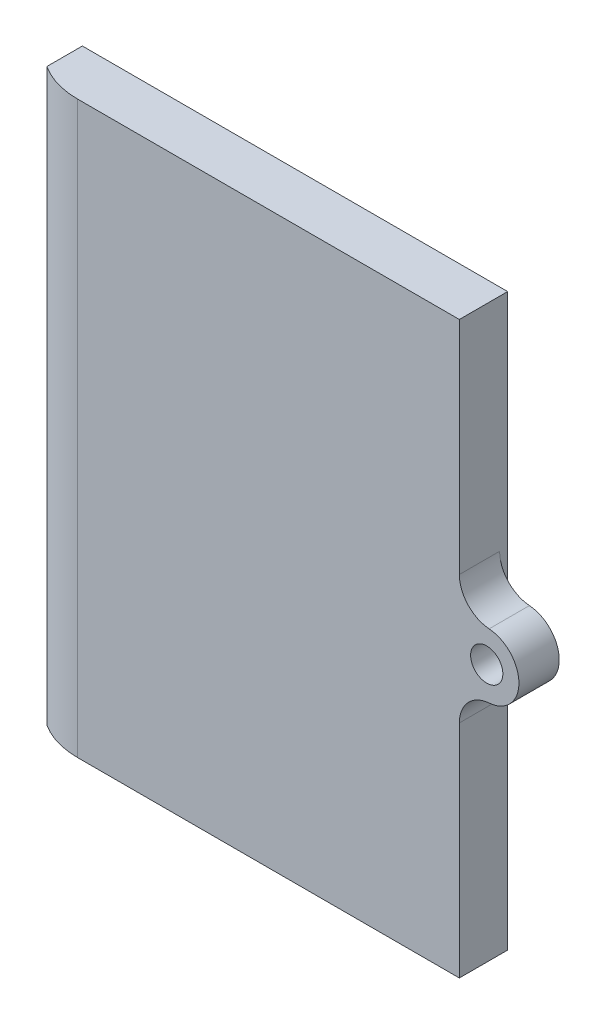
ISO-10303-21;
HEADER;
FILE_DESCRIPTION(('STEP AP214'),'2;1');
FILE_NAME('part.step','',(''),(''),'','','');
FILE_SCHEMA(('AUTOMOTIVE_DESIGN { 1 0 10303 214 1 1 1 1 }'));
ENDSEC;
DATA;
#1=APPLICATION_CONTEXT('core data for automotive mechanical design processes');
#2=APPLICATION_PROTOCOL_DEFINITION('international standard','automotive_design',2000,#1);
#3=PRODUCT_CONTEXT('',#1,'mechanical');
#4=PRODUCT('Part','Part','',(#3));
#5=PRODUCT_RELATED_PRODUCT_CATEGORY('part','',(#4));
#6=PRODUCT_DEFINITION_FORMATION('','',#4);
#7=PRODUCT_DEFINITION_CONTEXT('part definition',#1,'design');
#8=PRODUCT_DEFINITION('design','',#6,#7);
#9=PRODUCT_DEFINITION_SHAPE('','',#8);
#10=(LENGTH_UNIT() NAMED_UNIT(*) SI_UNIT(.MILLI.,.METRE.));
#11=(NAMED_UNIT(*) PLANE_ANGLE_UNIT() SI_UNIT($,.RADIAN.));
#12=(NAMED_UNIT(*) SI_UNIT($,.STERADIAN.) SOLID_ANGLE_UNIT());
#13=UNCERTAINTY_MEASURE_WITH_UNIT(LENGTH_MEASURE(1.E-05),#10,'distance_accuracy_value','');
#14=(GEOMETRIC_REPRESENTATION_CONTEXT(3) GLOBAL_UNCERTAINTY_ASSIGNED_CONTEXT((#13)) GLOBAL_UNIT_ASSIGNED_CONTEXT((#10,
#11,#12)) REPRESENTATION_CONTEXT('',''));
#15=CARTESIAN_POINT('',(0.,0.,0.));
#16=DIRECTION('',(0.,0.,1.));
#17=DIRECTION('',(1.,0.,0.));
#18=AXIS2_PLACEMENT_3D('',#15,#16,#17);
#19=CARTESIAN_POINT('',(-12.,35.4,-2.5));
#20=DIRECTION('',(0.,-1.,0.));
#21=DIRECTION('',(0.,0.,-1.));
#22=AXIS2_PLACEMENT_3D('',#19,#20,#21);
#23=CYLINDRICAL_SURFACE('',#22,5.);
#24=CARTESIAN_POINT('',(-12.,35.4,-2.5));
#25=DIRECTION('',(0.,1.,0.));
#26=DIRECTION('',(0.,0.,-1.));
#27=AXIS2_PLACEMENT_3D('',#24,#25,#26);
#28=CIRCLE('',#27,5.);
#29=CARTESIAN_POINT('',(-14.7,35.4,1.70832508250016));
#30=VERTEX_POINT('',#29);
#31=CARTESIAN_POINT('',(-12.,35.4,2.5));
#32=VERTEX_POINT('',#31);
#33=EDGE_CURVE('E146',#30,#32,#28,.T.);
#34=ORIENTED_EDGE('',*,*,#33,.F.);
#35=DIRECTION('',(0.,-1.,0.));
#36=VECTOR('',#35,1.);
#37=CARTESIAN_POINT('',(-14.7,35.4,1.70832508250016));
#38=LINE('',#37,#36);
#39=CARTESIAN_POINT('',(-14.7,0.,1.70832508250016));
#40=VERTEX_POINT('',#39);
#41=EDGE_CURVE('E132',#30,#40,#38,.T.);
#42=ORIENTED_EDGE('',*,*,#41,.T.);
#43=CARTESIAN_POINT('',(-12.,0.,-2.5));
#44=DIRECTION('',(0.,1.,0.));
#45=DIRECTION('',(0.,0.,-1.));
#46=AXIS2_PLACEMENT_3D('',#43,#44,#45);
#47=CIRCLE('',#46,5.);
#48=CARTESIAN_POINT('',(-12.,0.,2.5));
#49=VERTEX_POINT('',#48);
#50=EDGE_CURVE('E131',#40,#49,#47,.T.);
#51=ORIENTED_EDGE('',*,*,#50,.T.);
#52=DIRECTION('',(0.,-1.,0.));
#53=VECTOR('',#52,1.);
#54=CARTESIAN_POINT('',(-12.,35.4,2.5));
#55=LINE('',#54,#53);
#56=EDGE_CURVE('E122',#32,#49,#55,.T.);
#57=ORIENTED_EDGE('',*,*,#56,.F.);
#58=EDGE_LOOP('',(#34,#42,#51,#57));
#59=FACE_BOUND('',#58,.T.);
#60=ADVANCED_FACE('F40',(#59),#23,.T.);
#61=CARTESIAN_POINT('',(-12.,35.4,2.5));
#62=DIRECTION('',(0.,0.,-1.));
#63=DIRECTION('',(-1.,0.,0.));
#64=AXIS2_PLACEMENT_3D('',#61,#62,#63);
#65=PLANE('',#64);
#66=DIRECTION('',(1.,0.,0.));
#67=VECTOR('',#66,1.);
#68=CARTESIAN_POINT('',(-12.,0.,2.5));
#69=LINE('',#68,#67);
#70=CARTESIAN_POINT('',(11.7,0.,2.5));
#71=VERTEX_POINT('',#70);
#72=EDGE_CURVE('E139',#49,#71,#69,.T.);
#73=ORIENTED_EDGE('',*,*,#72,.T.);
#74=DIRECTION('',(0.,1.,0.));
#75=VECTOR('',#74,1.);
#76=CARTESIAN_POINT('',(11.7,38.616725582953,2.5));
#77=LINE('',#76,#75);
#78=CARTESIAN_POINT('',(11.7,13.7112658649642,2.5));
#79=VERTEX_POINT('',#78);
#80=EDGE_CURVE('E133',#71,#79,#77,.T.);
#81=ORIENTED_EDGE('',*,*,#80,.T.);
#82=CARTESIAN_POINT('',(13.7,13.7112658649642,2.5));
#83=DIRECTION('',(0.,0.,-1.));
#84=DIRECTION('',(-1.,0.,0.));
#85=AXIS2_PLACEMENT_3D('',#82,#83,#84);
#86=CIRCLE('',#85,2.);
#87=CARTESIAN_POINT('',(13.55,15.7056329324821,2.5));
#88=VERTEX_POINT('',#87);
#89=EDGE_CURVE('E62',#79,#88,#86,.T.);
#90=ORIENTED_EDGE('',*,*,#89,.T.);
#91=CARTESIAN_POINT('',(13.4,17.7,2.5));
#92=DIRECTION('',(0.,0.,1.));
#93=DIRECTION('',(1.,0.,0.));
#94=AXIS2_PLACEMENT_3D('',#91,#92,#93);
#95=CIRCLE('',#94,2.);
#96=CARTESIAN_POINT('',(13.55,19.6943670675179,2.5));
#97=VERTEX_POINT('',#96);
#98=EDGE_CURVE('E175',#88,#97,#95,.T.);
#99=ORIENTED_EDGE('',*,*,#98,.T.);
#100=CARTESIAN_POINT('',(13.7,21.6887341350358,2.5));
#101=DIRECTION('',(0.,0.,-1.));
#102=DIRECTION('',(-1.,0.,0.));
#103=AXIS2_PLACEMENT_3D('',#100,#101,#102);
#104=CIRCLE('',#103,2.);
#105=CARTESIAN_POINT('',(11.7,21.6887341350358,2.5));
#106=VERTEX_POINT('',#105);
#107=EDGE_CURVE('E48',#97,#106,#104,.T.);
#108=ORIENTED_EDGE('',*,*,#107,.T.);
#109=CARTESIAN_POINT('',(11.7,35.4,2.5));
#110=VERTEX_POINT('',#109);
#111=EDGE_CURVE('E173',#106,#110,#77,.T.);
#112=ORIENTED_EDGE('',*,*,#111,.T.);
#113=DIRECTION('',(1.,0.,0.));
#114=VECTOR('',#113,1.);
#115=CARTESIAN_POINT('',(-12.,35.4,2.5));
#116=LINE('',#115,#114);
#117=EDGE_CURVE('E148',#32,#110,#116,.T.);
#118=ORIENTED_EDGE('',*,*,#117,.F.);
#119=ORIENTED_EDGE('',*,*,#56,.T.);
#120=EDGE_LOOP('',(#73,#81,#90,#99,#108,#112,#118,#119));
#121=FACE_BOUND('',#120,.T.);
#122=CARTESIAN_POINT('',(13.4,17.7,2.5));
#123=DIRECTION('',(0.,0.,1.));
#124=DIRECTION('',(1.,0.,0.));
#125=AXIS2_PLACEMENT_3D('',#122,#123,#124);
#126=CIRCLE('',#125,1.);
#127=CARTESIAN_POINT('',(14.4,17.7,2.5));
#128=VERTEX_POINT('',#127);
#129=EDGE_CURVE('E198',#128,#128,#126,.T.);
#130=ORIENTED_EDGE('',*,*,#129,.F.);
#131=EDGE_LOOP('',(#130));
#132=FACE_BOUND('',#131,.T.);
#133=ADVANCED_FACE('F170',(#121,#132),#65,.F.);
#134=CARTESIAN_POINT('',(-12.,35.4,-2.5));
#135=DIRECTION('',(0.,-1.,0.));
#136=DIRECTION('',(0.,0.,-1.));
#137=AXIS2_PLACEMENT_3D('',#134,#135,#136);
#138=PLANE('',#137);
#139=ORIENTED_EDGE('',*,*,#117,.T.);
#140=DIRECTION('',(0.,0.,-1.));
#141=VECTOR('',#140,1.);
#142=CARTESIAN_POINT('',(11.7,35.4,-2.5));
#143=LINE('',#142,#141);
#144=CARTESIAN_POINT('',(11.7,35.4,-0.5));
#145=VERTEX_POINT('',#144);
#146=EDGE_CURVE('E141',#110,#145,#143,.T.);
#147=ORIENTED_EDGE('',*,*,#146,.T.);
#148=DIRECTION('',(1.,0.,0.));
#149=VECTOR('',#148,1.);
#150=CARTESIAN_POINT('',(12.,35.4,-0.5));
#151=LINE('',#150,#149);
#152=CARTESIAN_POINT('',(-14.7,35.4,-0.499999999999996));
#153=VERTEX_POINT('',#152);
#154=EDGE_CURVE('E137',#153,#145,#151,.T.);
#155=ORIENTED_EDGE('',*,*,#154,.F.);
#156=DIRECTION('',(0.,0.,1.));
#157=VECTOR('',#156,1.);
#158=CARTESIAN_POINT('',(-14.7,35.4,-2.5));
#159=LINE('',#158,#157);
#160=EDGE_CURVE('E116',#153,#30,#159,.T.);
#161=ORIENTED_EDGE('',*,*,#160,.T.);
#162=ORIENTED_EDGE('',*,*,#33,.T.);
#163=EDGE_LOOP('',(#139,#147,#155,#161,#162));
#164=FACE_BOUND('',#163,.T.);
#165=ADVANCED_FACE('F205',(#164),#138,.F.);
#166=CARTESIAN_POINT('',(-12.,0.,-2.5));
#167=DIRECTION('',(0.,-1.,0.));
#168=DIRECTION('',(0.,0.,-1.));
#169=AXIS2_PLACEMENT_3D('',#166,#167,#168);
#170=PLANE('',#169);
#171=DIRECTION('',(0.,0.,-1.));
#172=VECTOR('',#171,1.);
#173=CARTESIAN_POINT('',(11.7,0.,-2.5));
#174=LINE('',#173,#172);
#175=CARTESIAN_POINT('',(11.7,0.,-0.5));
#176=VERTEX_POINT('',#175);
#177=EDGE_CURVE('E203',#71,#176,#174,.T.);
#178=ORIENTED_EDGE('',*,*,#177,.F.);
#179=ORIENTED_EDGE('',*,*,#72,.F.);
#180=ORIENTED_EDGE('',*,*,#50,.F.);
#181=DIRECTION('',(0.,0.,1.));
#182=VECTOR('',#181,1.);
#183=CARTESIAN_POINT('',(-14.7,0.,-2.5));
#184=LINE('',#183,#182);
#185=CARTESIAN_POINT('',(-14.7,0.,-0.499999999999996));
#186=VERTEX_POINT('',#185);
#187=EDGE_CURVE('E113',#186,#40,#184,.T.);
#188=ORIENTED_EDGE('',*,*,#187,.F.);
#189=DIRECTION('',(1.,0.,0.));
#190=VECTOR('',#189,1.);
#191=CARTESIAN_POINT('',(12.,0.,-0.5));
#192=LINE('',#191,#190);
#193=EDGE_CURVE('E129',#186,#176,#192,.T.);
#194=ORIENTED_EDGE('',*,*,#193,.T.);
#195=EDGE_LOOP('',(#178,#179,#180,#188,#194));
#196=FACE_BOUND('',#195,.T.);
#197=ADVANCED_FACE('F128',(#196),#170,.T.);
#198=CARTESIAN_POINT('',(12.,0.,-0.5));
#199=DIRECTION('',(0.,0.,1.));
#200=DIRECTION('',(1.,0.,0.));
#201=AXIS2_PLACEMENT_3D('',#198,#199,#200);
#202=PLANE('',#201);
#203=ORIENTED_EDGE('',*,*,#154,.T.);
#204=DIRECTION('',(0.,-1.,0.));
#205=VECTOR('',#204,1.);
#206=CARTESIAN_POINT('',(11.7,0.,-0.5));
#207=LINE('',#206,#205);
#208=EDGE_CURVE('E121',#145,#176,#207,.T.);
#209=ORIENTED_EDGE('',*,*,#208,.T.);
#210=ORIENTED_EDGE('',*,*,#193,.F.);
#211=DIRECTION('',(0.,1.,0.));
#212=VECTOR('',#211,1.);
#213=CARTESIAN_POINT('',(-14.7,0.,-0.499999999999996));
#214=LINE('',#213,#212);
#215=EDGE_CURVE('E110',#186,#153,#214,.T.);
#216=ORIENTED_EDGE('',*,*,#215,.T.);
#217=EDGE_LOOP('',(#203,#209,#210,#216));
#218=FACE_BOUND('',#217,.T.);
#219=ADVANCED_FACE('F136',(#218),#202,.F.);
#220=CARTESIAN_POINT('',(-14.7,39.0893189092586,2.5));
#221=DIRECTION('',(1.,0.,0.));
#222=DIRECTION('',(0.,0.,-1.));
#223=AXIS2_PLACEMENT_3D('',#220,#221,#222);
#224=PLANE('',#223);
#225=ORIENTED_EDGE('',*,*,#215,.F.);
#226=ORIENTED_EDGE('',*,*,#187,.T.);
#227=ORIENTED_EDGE('',*,*,#41,.F.);
#228=ORIENTED_EDGE('',*,*,#160,.F.);
#229=EDGE_LOOP('',(#225,#226,#227,#228));
#230=FACE_BOUND('',#229,.T.);
#231=ADVANCED_FACE('F112',(#230),#224,.F.);
#232=CARTESIAN_POINT('',(11.7,38.616725582953,2.5));
#233=DIRECTION('',(-1.,0.,0.));
#234=DIRECTION('',(0.,0.,1.));
#235=AXIS2_PLACEMENT_3D('',#232,#233,#234);
#236=PLANE('',#235);
#237=DIRECTION('',(0.,1.,0.));
#238=VECTOR('',#237,1.);
#239=CARTESIAN_POINT('',(11.7,19.7,0.));
#240=LINE('',#239,#238);
#241=CARTESIAN_POINT('',(11.7,13.7112658649642,0.));
#242=VERTEX_POINT('',#241);
#243=CARTESIAN_POINT('',(11.7,21.6887341350358,0.));
#244=VERTEX_POINT('',#243);
#245=EDGE_CURVE('E189',#242,#244,#240,.T.);
#246=ORIENTED_EDGE('',*,*,#245,.F.);
#247=DIRECTION('',(0.,0.,1.));
#248=VECTOR('',#247,1.);
#249=CARTESIAN_POINT('',(11.7,13.7112658649642,2.5));
#250=LINE('',#249,#248);
#251=EDGE_CURVE('E159',#242,#79,#250,.T.);
#252=ORIENTED_EDGE('',*,*,#251,.T.);
#253=ORIENTED_EDGE('',*,*,#80,.F.);
#254=ORIENTED_EDGE('',*,*,#177,.T.);
#255=ORIENTED_EDGE('',*,*,#208,.F.);
#256=ORIENTED_EDGE('',*,*,#146,.F.);
#257=ORIENTED_EDGE('',*,*,#111,.F.);
#258=DIRECTION('',(0.,0.,1.));
#259=VECTOR('',#258,1.);
#260=CARTESIAN_POINT('',(11.7,21.6887341350358,2.5));
#261=LINE('',#260,#259);
#262=EDGE_CURVE('E156',#106,#244,#261,.F.);
#263=ORIENTED_EDGE('',*,*,#262,.T.);
#264=EDGE_LOOP('',(#246,#252,#253,#254,#255,#256,#257,#263));
#265=FACE_BOUND('',#264,.T.);
#266=ADVANCED_FACE('F177',(#265),#236,.F.);
#267=CARTESIAN_POINT('',(13.4,17.7,-5.94885309033012));
#268=DIRECTION('',(0.,0.,1.));
#269=DIRECTION('',(1.,0.,0.));
#270=AXIS2_PLACEMENT_3D('',#267,#268,#269);
#271=CYLINDRICAL_SURFACE('',#270,2.);
#272=ORIENTED_EDGE('',*,*,#98,.F.);
#273=DIRECTION('',(0.,0.,1.));
#274=VECTOR('',#273,1.);
#275=CARTESIAN_POINT('',(13.55,15.7056329324821,-5.94885309033012));
#276=LINE('',#275,#274);
#277=CARTESIAN_POINT('',(13.55,15.7056329324821,0.));
#278=VERTEX_POINT('',#277);
#279=EDGE_CURVE('E164',#88,#278,#276,.F.);
#280=ORIENTED_EDGE('',*,*,#279,.T.);
#281=CARTESIAN_POINT('',(13.4,17.7,0.));
#282=DIRECTION('',(0.,0.,1.));
#283=DIRECTION('',(1.,0.,0.));
#284=AXIS2_PLACEMENT_3D('',#281,#282,#283);
#285=CIRCLE('',#284,2.);
#286=CARTESIAN_POINT('',(13.55,19.6943670675179,0.));
#287=VERTEX_POINT('',#286);
#288=EDGE_CURVE('E187',#287,#278,#285,.F.);
#289=ORIENTED_EDGE('',*,*,#288,.F.);
#290=DIRECTION('',(0.,0.,1.));
#291=VECTOR('',#290,1.);
#292=CARTESIAN_POINT('',(13.55,19.6943670675179,-5.94885309033012));
#293=LINE('',#292,#291);
#294=EDGE_CURVE('E162',#287,#97,#293,.T.);
#295=ORIENTED_EDGE('',*,*,#294,.T.);
#296=EDGE_LOOP('',(#272,#280,#289,#295));
#297=FACE_BOUND('',#296,.T.);
#298=ADVANCED_FACE('F191',(#297),#271,.T.);
#299=CARTESIAN_POINT('',(13.4,17.7,-5.94885309033012));
#300=DIRECTION('',(0.,0.,1.));
#301=DIRECTION('',(1.,0.,0.));
#302=AXIS2_PLACEMENT_3D('',#299,#300,#301);
#303=CYLINDRICAL_SURFACE('',#302,1.);
#304=CARTESIAN_POINT('',(13.4,17.7,0.));
#305=DIRECTION('',(0.,0.,1.));
#306=DIRECTION('',(1.,0.,0.));
#307=AXIS2_PLACEMENT_3D('',#304,#305,#306);
#308=CIRCLE('',#307,1.);
#309=CARTESIAN_POINT('',(14.4,17.7,0.));
#310=VERTEX_POINT('',#309);
#311=EDGE_CURVE('E180',#310,#310,#308,.F.);
#312=ORIENTED_EDGE('',*,*,#311,.T.);
#313=EDGE_LOOP('',(#312));
#314=FACE_BOUND('',#313,.T.);
#315=ORIENTED_EDGE('',*,*,#129,.T.);
#316=EDGE_LOOP('',(#315));
#317=FACE_BOUND('',#316,.T.);
#318=ADVANCED_FACE('F223',(#314,#317),#303,.F.);
#319=CARTESIAN_POINT('',(12.,0.,0.));
#320=DIRECTION('',(0.,0.,1.));
#321=DIRECTION('',(1.,0.,0.));
#322=AXIS2_PLACEMENT_3D('',#319,#320,#321);
#323=PLANE('',#322);
#324=ORIENTED_EDGE('',*,*,#245,.T.);
#325=CARTESIAN_POINT('',(13.7,21.6887341350358,0.));
#326=DIRECTION('',(0.,0.,1.));
#327=DIRECTION('',(1.,0.,0.));
#328=AXIS2_PLACEMENT_3D('',#325,#326,#327);
#329=CIRCLE('',#328,2.);
#330=EDGE_CURVE('E12',#244,#287,#329,.T.);
#331=ORIENTED_EDGE('',*,*,#330,.T.);
#332=ORIENTED_EDGE('',*,*,#288,.T.);
#333=CARTESIAN_POINT('',(13.7,13.7112658649642,0.));
#334=DIRECTION('',(0.,0.,1.));
#335=DIRECTION('',(1.,0.,0.));
#336=AXIS2_PLACEMENT_3D('',#333,#334,#335);
#337=CIRCLE('',#336,2.);
#338=EDGE_CURVE('E167',#278,#242,#337,.T.);
#339=ORIENTED_EDGE('',*,*,#338,.T.);
#340=EDGE_LOOP('',(#324,#331,#332,#339));
#341=FACE_BOUND('',#340,.T.);
#342=ORIENTED_EDGE('',*,*,#311,.F.);
#343=EDGE_LOOP('',(#342));
#344=FACE_BOUND('',#343,.T.);
#345=ADVANCED_FACE('F185',(#341,#344),#323,.F.);
#346=CARTESIAN_POINT('',(13.7,13.7112658649642,-5.94885309033012));
#347=DIRECTION('',(0.,0.,1.));
#348=DIRECTION('',(1.,0.,0.));
#349=AXIS2_PLACEMENT_3D('',#346,#347,#348);
#350=CYLINDRICAL_SURFACE('',#349,2.);
#351=ORIENTED_EDGE('',*,*,#338,.F.);
#352=ORIENTED_EDGE('',*,*,#279,.F.);
#353=ORIENTED_EDGE('',*,*,#89,.F.);
#354=ORIENTED_EDGE('',*,*,#251,.F.);
#355=EDGE_LOOP('',(#351,#352,#353,#354));
#356=FACE_BOUND('',#355,.T.);
#357=ADVANCED_FACE('F216',(#356),#350,.F.);
#358=CARTESIAN_POINT('',(13.7,21.6887341350358,-5.94885309033012));
#359=DIRECTION('',(0.,0.,1.));
#360=DIRECTION('',(1.,0.,0.));
#361=AXIS2_PLACEMENT_3D('',#358,#359,#360);
#362=CYLINDRICAL_SURFACE('',#361,2.);
#363=ORIENTED_EDGE('',*,*,#330,.F.);
#364=ORIENTED_EDGE('',*,*,#262,.F.);
#365=ORIENTED_EDGE('',*,*,#107,.F.);
#366=ORIENTED_EDGE('',*,*,#294,.F.);
#367=EDGE_LOOP('',(#363,#364,#365,#366));
#368=FACE_BOUND('',#367,.T.);
#369=ADVANCED_FACE('F42',(#368),#362,.F.);
#370=CLOSED_SHELL('',(#60,#133,#165,#197,#219,#231,#266,#298,#318,#345,#357,#369));
#371=MANIFOLD_SOLID_BREP('B2',#370);
#372=ADVANCED_BREP_SHAPE_REPRESENTATION('',(#18,#371),#14);
#373=SHAPE_DEFINITION_REPRESENTATION(#9,#372);
ENDSEC;
END-ISO-10303-21;
